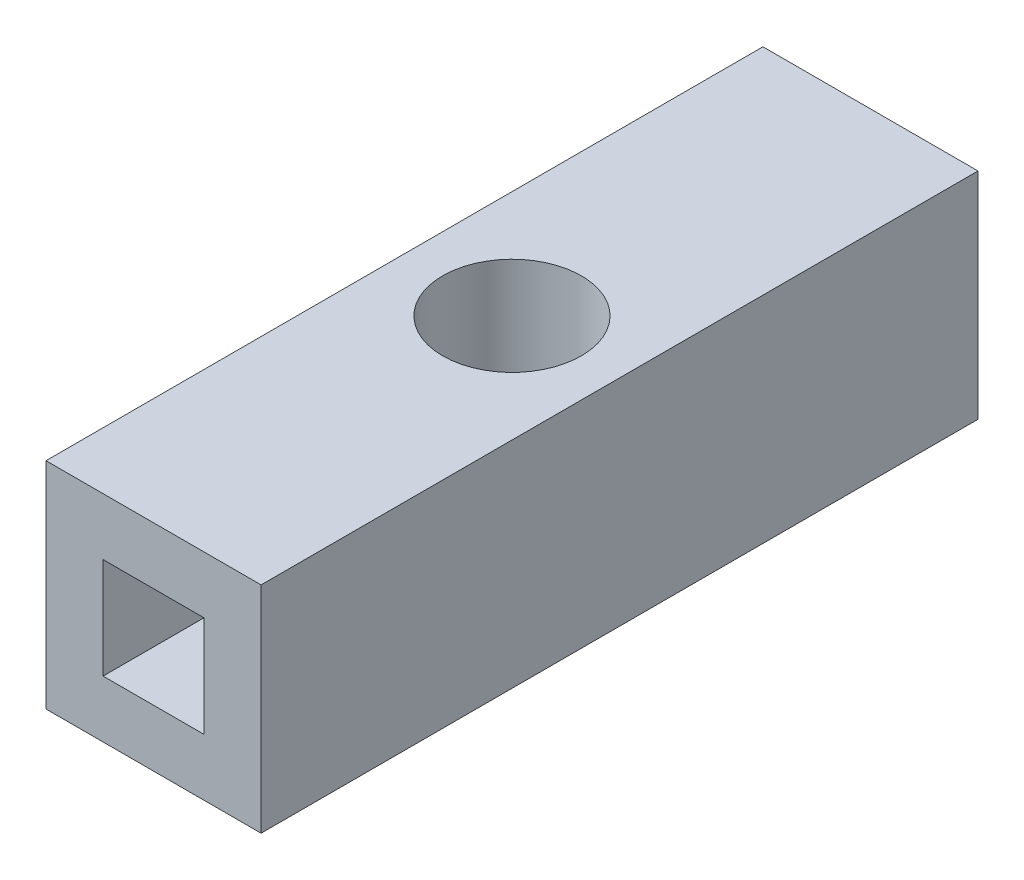
ISO-10303-21;
HEADER;
FILE_DESCRIPTION(('STEP AP214'),'2;1');
FILE_NAME('part.step','',(''),(''),'','','');
FILE_SCHEMA(('AUTOMOTIVE_DESIGN { 1 0 10303 214 1 1 1 1 }'));
ENDSEC;
DATA;
#1=APPLICATION_CONTEXT('core data for automotive mechanical design processes');
#2=APPLICATION_PROTOCOL_DEFINITION('international standard','automotive_design',2000,#1);
#3=PRODUCT_CONTEXT('',#1,'mechanical');
#4=PRODUCT('Part','Part','',(#3));
#5=PRODUCT_RELATED_PRODUCT_CATEGORY('part','',(#4));
#6=PRODUCT_DEFINITION_FORMATION('','',#4);
#7=PRODUCT_DEFINITION_CONTEXT('part definition',#1,'design');
#8=PRODUCT_DEFINITION('design','',#6,#7);
#9=PRODUCT_DEFINITION_SHAPE('','',#8);
#10=(LENGTH_UNIT() NAMED_UNIT(*) SI_UNIT(.MILLI.,.METRE.));
#11=(NAMED_UNIT(*) PLANE_ANGLE_UNIT() SI_UNIT($,.RADIAN.));
#12=(NAMED_UNIT(*) SI_UNIT($,.STERADIAN.) SOLID_ANGLE_UNIT());
#13=UNCERTAINTY_MEASURE_WITH_UNIT(LENGTH_MEASURE(1.E-05),#10,'distance_accuracy_value','');
#14=(GEOMETRIC_REPRESENTATION_CONTEXT(3) GLOBAL_UNCERTAINTY_ASSIGNED_CONTEXT((#13)) GLOBAL_UNIT_ASSIGNED_CONTEXT((#10,
#11,#12)) REPRESENTATION_CONTEXT('',''));
#15=CARTESIAN_POINT('',(0.,0.,0.));
#16=DIRECTION('',(0.,0.,1.));
#17=DIRECTION('',(1.,0.,0.));
#18=AXIS2_PLACEMENT_3D('',#15,#16,#17);
#19=CARTESIAN_POINT('',(3.81,3.81,12.7));
#20=DIRECTION('',(-1.,0.,0.));
#21=DIRECTION('',(0.,-1.,0.));
#22=AXIS2_PLACEMENT_3D('',#19,#20,#21);
#23=PLANE('',#22);
#24=DIRECTION('',(0.,1.,0.));
#25=VECTOR('',#24,1.);
#26=CARTESIAN_POINT('',(3.81,3.81,-12.7));
#27=LINE('',#26,#25);
#28=CARTESIAN_POINT('',(3.81,-3.81,-12.7));
#29=VERTEX_POINT('',#28);
#30=CARTESIAN_POINT('',(3.81,3.81,-12.7));
#31=VERTEX_POINT('',#30);
#32=EDGE_CURVE('E165',#29,#31,#27,.T.);
#33=ORIENTED_EDGE('',*,*,#32,.T.);
#34=DIRECTION('',(0.,0.,-1.));
#35=VECTOR('',#34,1.);
#36=CARTESIAN_POINT('',(3.81,3.81,12.7));
#37=LINE('',#36,#35);
#38=CARTESIAN_POINT('',(3.81,3.81,12.7));
#39=VERTEX_POINT('',#38);
#40=EDGE_CURVE('E12',#39,#31,#37,.T.);
#41=ORIENTED_EDGE('',*,*,#40,.F.);
#42=DIRECTION('',(0.,1.,0.));
#43=VECTOR('',#42,1.);
#44=CARTESIAN_POINT('',(3.81,3.81,12.7));
#45=LINE('',#44,#43);
#46=CARTESIAN_POINT('',(3.81,-3.81,12.7));
#47=VERTEX_POINT('',#46);
#48=EDGE_CURVE('E166',#47,#39,#45,.T.);
#49=ORIENTED_EDGE('',*,*,#48,.F.);
#50=DIRECTION('',(0.,0.,-1.));
#51=VECTOR('',#50,1.);
#52=CARTESIAN_POINT('',(3.81,-3.81,12.7));
#53=LINE('',#52,#51);
#54=EDGE_CURVE('E176',#47,#29,#53,.T.);
#55=ORIENTED_EDGE('',*,*,#54,.T.);
#56=EDGE_LOOP('',(#33,#41,#49,#55));
#57=FACE_BOUND('',#56,.T.);
#58=ADVANCED_FACE('F35',(#57),#23,.F.);
#59=CARTESIAN_POINT('',(-3.81,3.81,12.7));
#60=DIRECTION('',(0.,-1.,0.));
#61=DIRECTION('',(0.,0.,-1.));
#62=AXIS2_PLACEMENT_3D('',#59,#60,#61);
#63=PLANE('',#62);
#64=CARTESIAN_POINT('',(0.,3.81,0.));
#65=DIRECTION('',(0.,1.,0.));
#66=DIRECTION('',(0.,0.,1.));
#67=AXIS2_PLACEMENT_3D('',#64,#65,#66);
#68=CIRCLE('',#67,2.45745);
#69=CARTESIAN_POINT('',(0.,3.81,2.45745));
#70=VERTEX_POINT('',#69);
#71=EDGE_CURVE('E151',#70,#70,#68,.T.);
#72=ORIENTED_EDGE('',*,*,#71,.F.);
#73=EDGE_LOOP('',(#72));
#74=FACE_BOUND('',#73,.T.);
#75=DIRECTION('',(-1.,0.,0.));
#76=VECTOR('',#75,1.);
#77=CARTESIAN_POINT('',(-3.81,3.81,-12.7));
#78=LINE('',#77,#76);
#79=CARTESIAN_POINT('',(-3.81,3.81,-12.7));
#80=VERTEX_POINT('',#79);
#81=EDGE_CURVE('E179',#31,#80,#78,.T.);
#82=ORIENTED_EDGE('',*,*,#81,.T.);
#83=DIRECTION('',(0.,0.,-1.));
#84=VECTOR('',#83,1.);
#85=CARTESIAN_POINT('',(-3.81,3.81,12.7));
#86=LINE('',#85,#84);
#87=CARTESIAN_POINT('',(-3.81,3.81,12.7));
#88=VERTEX_POINT('',#87);
#89=EDGE_CURVE('E42',#88,#80,#86,.T.);
#90=ORIENTED_EDGE('',*,*,#89,.F.);
#91=DIRECTION('',(-1.,0.,0.));
#92=VECTOR('',#91,1.);
#93=CARTESIAN_POINT('',(-3.81,3.81,12.7));
#94=LINE('',#93,#92);
#95=EDGE_CURVE('E169',#39,#88,#94,.T.);
#96=ORIENTED_EDGE('',*,*,#95,.F.);
#97=ORIENTED_EDGE('',*,*,#40,.T.);
#98=EDGE_LOOP('',(#82,#90,#96,#97));
#99=FACE_BOUND('',#98,.T.);
#100=ADVANCED_FACE('F207',(#74,#99),#63,.F.);
#101=CARTESIAN_POINT('',(-3.81,3.81,12.7));
#102=DIRECTION('',(1.,0.,0.));
#103=DIRECTION('',(0.,1.,0.));
#104=AXIS2_PLACEMENT_3D('',#101,#102,#103);
#105=PLANE('',#104);
#106=DIRECTION('',(0.,-1.,0.));
#107=VECTOR('',#106,1.);
#108=CARTESIAN_POINT('',(-3.81,3.81,-12.7));
#109=LINE('',#108,#107);
#110=CARTESIAN_POINT('',(-3.81,-3.81,-12.7));
#111=VERTEX_POINT('',#110);
#112=EDGE_CURVE('E181',#80,#111,#109,.T.);
#113=ORIENTED_EDGE('',*,*,#112,.T.);
#114=DIRECTION('',(0.,0.,-1.));
#115=VECTOR('',#114,1.);
#116=CARTESIAN_POINT('',(-3.81,-3.81,12.7));
#117=LINE('',#116,#115);
#118=CARTESIAN_POINT('',(-3.81,-3.81,12.7));
#119=VERTEX_POINT('',#118);
#120=EDGE_CURVE('E186',#119,#111,#117,.T.);
#121=ORIENTED_EDGE('',*,*,#120,.F.);
#122=DIRECTION('',(0.,-1.,0.));
#123=VECTOR('',#122,1.);
#124=CARTESIAN_POINT('',(-3.81,3.81,12.7));
#125=LINE('',#124,#123);
#126=EDGE_CURVE('E172',#88,#119,#125,.T.);
#127=ORIENTED_EDGE('',*,*,#126,.F.);
#128=ORIENTED_EDGE('',*,*,#89,.T.);
#129=EDGE_LOOP('',(#113,#121,#127,#128));
#130=FACE_BOUND('',#129,.T.);
#131=ADVANCED_FACE('F193',(#130),#105,.F.);
#132=CARTESIAN_POINT('',(-3.81,-3.81,12.7));
#133=DIRECTION('',(0.,1.,0.));
#134=DIRECTION('',(0.,0.,1.));
#135=AXIS2_PLACEMENT_3D('',#132,#133,#134);
#136=PLANE('',#135);
#137=CARTESIAN_POINT('',(0.,-3.81,0.));
#138=DIRECTION('',(0.,1.,0.));
#139=DIRECTION('',(0.,0.,1.));
#140=AXIS2_PLACEMENT_3D('',#137,#138,#139);
#141=CIRCLE('',#140,2.45745);
#142=CARTESIAN_POINT('',(0.,-3.81,2.45745));
#143=VERTEX_POINT('',#142);
#144=EDGE_CURVE('E162',#143,#143,#141,.T.);
#145=ORIENTED_EDGE('',*,*,#144,.T.);
#146=EDGE_LOOP('',(#145));
#147=FACE_BOUND('',#146,.T.);
#148=DIRECTION('',(1.,0.,0.));
#149=VECTOR('',#148,1.);
#150=CARTESIAN_POINT('',(-3.81,-3.81,-12.7));
#151=LINE('',#150,#149);
#152=EDGE_CURVE('E170',#111,#29,#151,.T.);
#153=ORIENTED_EDGE('',*,*,#152,.T.);
#154=ORIENTED_EDGE('',*,*,#54,.F.);
#155=DIRECTION('',(1.,0.,0.));
#156=VECTOR('',#155,1.);
#157=CARTESIAN_POINT('',(-3.81,-3.81,12.7));
#158=LINE('',#157,#156);
#159=EDGE_CURVE('E174',#119,#47,#158,.T.);
#160=ORIENTED_EDGE('',*,*,#159,.F.);
#161=ORIENTED_EDGE('',*,*,#120,.T.);
#162=EDGE_LOOP('',(#153,#154,#160,#161));
#163=FACE_BOUND('',#162,.T.);
#164=ADVANCED_FACE('F200',(#147,#163),#136,.F.);
#165=CARTESIAN_POINT('',(0.,0.,12.7));
#166=DIRECTION('',(0.,0.,1.));
#167=DIRECTION('',(1.,0.,0.));
#168=AXIS2_PLACEMENT_3D('',#165,#166,#167);
#169=PLANE('',#168);
#170=DIRECTION('',(1.,0.,0.));
#171=VECTOR('',#170,1.);
#172=CARTESIAN_POINT('',(-1.7875,-1.7875,12.7));
#173=LINE('',#172,#171);
#174=CARTESIAN_POINT('',(-1.7875,-1.7875,12.7));
#175=VERTEX_POINT('',#174);
#176=CARTESIAN_POINT('',(1.7875,-1.7875,12.7));
#177=VERTEX_POINT('',#176);
#178=EDGE_CURVE('E57',#175,#177,#173,.T.);
#179=ORIENTED_EDGE('',*,*,#178,.F.);
#180=DIRECTION('',(0.,-1.,0.));
#181=VECTOR('',#180,1.);
#182=CARTESIAN_POINT('',(-1.7875,1.7875,12.7));
#183=LINE('',#182,#181);
#184=CARTESIAN_POINT('',(-1.7875,1.7875,12.7));
#185=VERTEX_POINT('',#184);
#186=EDGE_CURVE('E139',#185,#175,#183,.T.);
#187=ORIENTED_EDGE('',*,*,#186,.F.);
#188=DIRECTION('',(-1.,0.,0.));
#189=VECTOR('',#188,1.);
#190=CARTESIAN_POINT('',(1.7875,1.7875,12.7));
#191=LINE('',#190,#189);
#192=CARTESIAN_POINT('',(1.7875,1.7875,12.7));
#193=VERTEX_POINT('',#192);
#194=EDGE_CURVE('E142',#193,#185,#191,.T.);
#195=ORIENTED_EDGE('',*,*,#194,.F.);
#196=DIRECTION('',(0.,1.,0.));
#197=VECTOR('',#196,1.);
#198=CARTESIAN_POINT('',(1.7875,-1.7875,12.7));
#199=LINE('',#198,#197);
#200=EDGE_CURVE('E134',#177,#193,#199,.T.);
#201=ORIENTED_EDGE('',*,*,#200,.F.);
#202=EDGE_LOOP('',(#179,#187,#195,#201));
#203=FACE_BOUND('',#202,.T.);
#204=ORIENTED_EDGE('',*,*,#48,.T.);
#205=ORIENTED_EDGE('',*,*,#95,.T.);
#206=ORIENTED_EDGE('',*,*,#126,.T.);
#207=ORIENTED_EDGE('',*,*,#159,.T.);
#208=EDGE_LOOP('',(#204,#205,#206,#207));
#209=FACE_BOUND('',#208,.T.);
#210=ADVANCED_FACE('F206',(#203,#209),#169,.T.);
#211=CARTESIAN_POINT('',(0.,0.,-12.7));
#212=DIRECTION('',(0.,0.,1.));
#213=DIRECTION('',(1.,0.,0.));
#214=AXIS2_PLACEMENT_3D('',#211,#212,#213);
#215=PLANE('',#214);
#216=CARTESIAN_POINT('',(0.,0.,-12.7));
#217=DIRECTION('',(0.,0.,-1.));
#218=DIRECTION('',(-1.,0.,0.));
#219=AXIS2_PLACEMENT_3D('',#216,#217,#218);
#220=CIRCLE('',#219,2.20000006400011);
#221=CARTESIAN_POINT('',(-1.699999936,1.39642418311933,-12.7));
#222=VERTEX_POINT('',#221);
#223=CARTESIAN_POINT('',(-1.699999936,-1.39642418311933,-12.7));
#224=VERTEX_POINT('',#223);
#225=EDGE_CURVE('E121',#222,#224,#220,.T.);
#226=ORIENTED_EDGE('',*,*,#225,.F.);
#227=DIRECTION('',(0.,1.,0.));
#228=VECTOR('',#227,1.);
#229=CARTESIAN_POINT('',(-1.699999936,-1.39642418311933,-12.7));
#230=LINE('',#229,#228);
#231=EDGE_CURVE('E49',#224,#222,#230,.T.);
#232=ORIENTED_EDGE('',*,*,#231,.F.);
#233=EDGE_LOOP('',(#226,#232));
#234=FACE_BOUND('',#233,.T.);
#235=ORIENTED_EDGE('',*,*,#32,.F.);
#236=ORIENTED_EDGE('',*,*,#152,.F.);
#237=ORIENTED_EDGE('',*,*,#112,.F.);
#238=ORIENTED_EDGE('',*,*,#81,.F.);
#239=EDGE_LOOP('',(#235,#236,#237,#238));
#240=FACE_BOUND('',#239,.T.);
#241=ADVANCED_FACE('F125',(#234,#240),#215,.F.);
#242=CARTESIAN_POINT('',(0.,3.81,0.));
#243=DIRECTION('',(0.,1.,0.));
#244=DIRECTION('',(0.,0.,1.));
#245=AXIS2_PLACEMENT_3D('',#242,#243,#244);
#246=CYLINDRICAL_SURFACE('',#245,2.45745);
#247=ORIENTED_EDGE('',*,*,#144,.F.);
#248=EDGE_LOOP('',(#247));
#249=FACE_BOUND('',#248,.T.);
#250=ORIENTED_EDGE('',*,*,#71,.T.);
#251=EDGE_LOOP('',(#250));
#252=FACE_BOUND('',#251,.T.);
#253=ADVANCED_FACE('F222',(#249,#252),#246,.F.);
#254=CARTESIAN_POINT('',(-1.7875,-1.7875,-12.701));
#255=DIRECTION('',(0.,-1.,0.));
#256=DIRECTION('',(0.,0.,-1.));
#257=AXIS2_PLACEMENT_3D('',#254,#255,#256);
#258=PLANE('',#257);
#259=CARTESIAN_POINT('',(0.,-1.7875,0.));
#260=DIRECTION('',(0.,-1.,0.));
#261=DIRECTION('',(0.,0.,-1.));
#262=AXIS2_PLACEMENT_3D('',#259,#260,#261);
#263=CIRCLE('',#262,3.47345);
#264=CARTESIAN_POINT('',(1.7875,-1.7875,2.97820393064343));
#265=VERTEX_POINT('',#264);
#266=CARTESIAN_POINT('',(-1.7875,-1.7875,2.97820393064343));
#267=VERTEX_POINT('',#266);
#268=EDGE_CURVE('E148',#265,#267,#263,.T.);
#269=ORIENTED_EDGE('',*,*,#268,.T.);
#270=DIRECTION('',(0.,0.,1.));
#271=VECTOR('',#270,1.);
#272=CARTESIAN_POINT('',(-1.7875,-1.7875,-12.701));
#273=LINE('',#272,#271);
#274=EDGE_CURVE('E156',#267,#175,#273,.T.);
#275=ORIENTED_EDGE('',*,*,#274,.T.);
#276=ORIENTED_EDGE('',*,*,#178,.T.);
#277=DIRECTION('',(0.,0.,1.));
#278=VECTOR('',#277,1.);
#279=CARTESIAN_POINT('',(1.7875,-1.7875,-12.701));
#280=LINE('',#279,#278);
#281=EDGE_CURVE('E133',#265,#177,#280,.T.);
#282=ORIENTED_EDGE('',*,*,#281,.F.);
#283=EDGE_LOOP('',(#269,#275,#276,#282));
#284=FACE_BOUND('',#283,.T.);
#285=ADVANCED_FACE('F228',(#284),#258,.F.);
#286=CARTESIAN_POINT('',(-1.7875,1.7875,-12.701));
#287=DIRECTION('',(-1.,0.,0.));
#288=DIRECTION('',(0.,0.,1.));
#289=AXIS2_PLACEMENT_3D('',#286,#287,#288);
#290=PLANE('',#289);
#291=DIRECTION('',(0.,1.,0.));
#292=VECTOR('',#291,1.);
#293=CARTESIAN_POINT('',(-1.7875,3.81,2.97820393064343));
#294=LINE('',#293,#292);
#295=CARTESIAN_POINT('',(-1.7875,1.7875,2.97820393064343));
#296=VERTEX_POINT('',#295);
#297=EDGE_CURVE('E149',#267,#296,#294,.T.);
#298=ORIENTED_EDGE('',*,*,#297,.T.);
#299=DIRECTION('',(0.,0.,1.));
#300=VECTOR('',#299,1.);
#301=CARTESIAN_POINT('',(-1.7875,1.7875,-12.701));
#302=LINE('',#301,#300);
#303=EDGE_CURVE('E154',#296,#185,#302,.T.);
#304=ORIENTED_EDGE('',*,*,#303,.T.);
#305=ORIENTED_EDGE('',*,*,#186,.T.);
#306=ORIENTED_EDGE('',*,*,#274,.F.);
#307=EDGE_LOOP('',(#298,#304,#305,#306));
#308=FACE_BOUND('',#307,.T.);
#309=ADVANCED_FACE('F250',(#308),#290,.F.);
#310=CARTESIAN_POINT('',(1.7875,1.7875,-12.701));
#311=DIRECTION('',(0.,1.,0.));
#312=DIRECTION('',(0.,0.,1.));
#313=AXIS2_PLACEMENT_3D('',#310,#311,#312);
#314=PLANE('',#313);
#315=CARTESIAN_POINT('',(0.,1.7875,0.));
#316=DIRECTION('',(0.,1.,0.));
#317=DIRECTION('',(0.,0.,1.));
#318=AXIS2_PLACEMENT_3D('',#315,#316,#317);
#319=CIRCLE('',#318,3.47345);
#320=CARTESIAN_POINT('',(1.7875,1.7875,2.97820393064343));
#321=VERTEX_POINT('',#320);
#322=EDGE_CURVE('E137',#296,#321,#319,.T.);
#323=ORIENTED_EDGE('',*,*,#322,.T.);
#324=DIRECTION('',(0.,0.,1.));
#325=VECTOR('',#324,1.);
#326=CARTESIAN_POINT('',(1.7875,1.7875,-12.701));
#327=LINE('',#326,#325);
#328=EDGE_CURVE('E145',#321,#193,#327,.T.);
#329=ORIENTED_EDGE('',*,*,#328,.T.);
#330=ORIENTED_EDGE('',*,*,#194,.T.);
#331=ORIENTED_EDGE('',*,*,#303,.F.);
#332=EDGE_LOOP('',(#323,#329,#330,#331));
#333=FACE_BOUND('',#332,.T.);
#334=ADVANCED_FACE('F240',(#333),#314,.F.);
#335=CARTESIAN_POINT('',(1.7875,-1.7875,-12.701));
#336=DIRECTION('',(1.,0.,0.));
#337=DIRECTION('',(0.,0.,-1.));
#338=AXIS2_PLACEMENT_3D('',#335,#336,#337);
#339=PLANE('',#338);
#340=DIRECTION('',(0.,1.,0.));
#341=VECTOR('',#340,1.);
#342=CARTESIAN_POINT('',(1.7875,3.81,2.97820393064343));
#343=LINE('',#342,#341);
#344=EDGE_CURVE('E146',#321,#265,#343,.F.);
#345=ORIENTED_EDGE('',*,*,#344,.T.);
#346=ORIENTED_EDGE('',*,*,#281,.T.);
#347=ORIENTED_EDGE('',*,*,#200,.T.);
#348=ORIENTED_EDGE('',*,*,#328,.F.);
#349=EDGE_LOOP('',(#345,#346,#347,#348));
#350=FACE_BOUND('',#349,.T.);
#351=ADVANCED_FACE('F233',(#350),#339,.F.);
#352=CARTESIAN_POINT('',(0.,3.81,0.));
#353=DIRECTION('',(0.,1.,0.));
#354=DIRECTION('',(0.,0.,1.));
#355=AXIS2_PLACEMENT_3D('',#352,#353,#354);
#356=CYLINDRICAL_SURFACE('',#355,3.47345);
#357=ORIENTED_EDGE('',*,*,#322,.F.);
#358=ORIENTED_EDGE('',*,*,#297,.F.);
#359=ORIENTED_EDGE('',*,*,#268,.F.);
#360=ORIENTED_EDGE('',*,*,#344,.F.);
#361=EDGE_LOOP('',(#357,#358,#359,#360));
#362=FACE_BOUND('',#361,.T.);
#363=ADVANCED_FACE('F230',(#362),#356,.T.);
#364=CARTESIAN_POINT('',(-1.699999936,-1.39642418311933,12.701));
#365=DIRECTION('',(-1.,0.,0.));
#366=DIRECTION('',(0.,0.,1.));
#367=AXIS2_PLACEMENT_3D('',#364,#365,#366);
#368=PLANE('',#367);
#369=DIRECTION('',(0.,1.,0.));
#370=VECTOR('',#369,1.);
#371=CARTESIAN_POINT('',(-1.699999936,3.81,-3.02900233081785));
#372=LINE('',#371,#370);
#373=CARTESIAN_POINT('',(-1.699999936,1.39642418311933,-3.02900233081784));
#374=VERTEX_POINT('',#373);
#375=CARTESIAN_POINT('',(-1.699999936,-1.39642418311933,-3.02900233081785));
#376=VERTEX_POINT('',#375);
#377=EDGE_CURVE('E115',#374,#376,#372,.F.);
#378=ORIENTED_EDGE('',*,*,#377,.T.);
#379=DIRECTION('',(0.,0.,-1.));
#380=VECTOR('',#379,1.);
#381=CARTESIAN_POINT('',(-1.699999936,-1.39642418311933,12.701));
#382=LINE('',#381,#380);
#383=EDGE_CURVE('E111',#376,#224,#382,.T.);
#384=ORIENTED_EDGE('',*,*,#383,.T.);
#385=ORIENTED_EDGE('',*,*,#231,.T.);
#386=DIRECTION('',(0.,0.,-1.));
#387=VECTOR('',#386,1.);
#388=CARTESIAN_POINT('',(-1.699999936,1.39642418311933,12.701));
#389=LINE('',#388,#387);
#390=EDGE_CURVE('E118',#374,#222,#389,.T.);
#391=ORIENTED_EDGE('',*,*,#390,.F.);
#392=EDGE_LOOP('',(#378,#384,#385,#391));
#393=FACE_BOUND('',#392,.T.);
#394=ADVANCED_FACE('F113',(#393),#368,.F.);
#395=CARTESIAN_POINT('',(0.,0.,12.701));
#396=DIRECTION('',(0.,0.,-1.));
#397=DIRECTION('',(-1.,0.,0.));
#398=AXIS2_PLACEMENT_3D('',#395,#396,#397);
#399=CYLINDRICAL_SURFACE('',#398,2.20000006400011);
#400=CARTESIAN_POINT('',(-1.699999936,-1.39642418311933,-3.02900233081785));
#401=CARTESIAN_POINT('',(-1.66091071626124,-1.44399620708811,-3.05094152030823));
#402=CARTESIAN_POINT('',(-1.61987872033584,-1.48988945480585,-3.07297357990735));
#403=CARTESIAN_POINT('',(-1.53400741157414,-1.57817237764945,-3.11672931127827));
#404=CARTESIAN_POINT('',(-1.48916620748426,-1.62056029153898,-3.13845282353649));
#405=CARTESIAN_POINT('',(-1.34850282838825,-1.74270321282816,-3.20266136929827));
#406=CARTESIAN_POINT('',(-1.24704995194177,-1.81681590794009,-3.24388678043658));
#407=CARTESIAN_POINT('',(-1.03052218090334,-1.94784430647262,-3.31904587232249));
#408=CARTESIAN_POINT('',(-0.915396624885104,-2.00469308965868,-3.35295103445591));
#409=CARTESIAN_POINT('',(-0.674858300807985,-2.09787817299546,-3.40948266142463));
#410=CARTESIAN_POINT('',(-0.549483468533163,-2.13428651320565,-3.43214870386373));
#411=CARTESIAN_POINT('',(-0.307187405201924,-2.18153714600308,-3.46174320916831));
#412=CARTESIAN_POINT('',(-0.190923667936593,-2.19481377746777,-3.4701668857097));
#413=CARTESIAN_POINT('',(0.0425401518803911,-2.20268363072507,-3.4751482214604));
#414=CARTESIAN_POINT('',(0.159740326747969,-2.19727498723565,-3.47170469601081));
#415=CARTESIAN_POINT('',(0.379356532822022,-2.16958930388246,-3.4542550826027));
#416=CARTESIAN_POINT('',(0.4820858403116,-2.14903880387401,-3.44133066879947));
#417=CARTESIAN_POINT('',(0.682304661189426,-2.09409634441932,-3.40729067933152));
#418=CARTESIAN_POINT('',(0.779794274268547,-2.05970464842259,-3.38617525957244));
#419=CARTESIAN_POINT('',(0.972378720809013,-1.97637249518646,-3.33612601396781));
#420=CARTESIAN_POINT('',(1.0671007142458,-1.92678207343487,-3.30684968912752));
#421=CARTESIAN_POINT('',(1.24720704859317,-1.81540722209198,-3.24321895237224));
#422=CARTESIAN_POINT('',(1.33258540086822,-1.75361504232655,-3.2088613164677));
#423=CARTESIAN_POINT('',(1.50472385595164,-1.6094060550015,-3.13221565849268));
#424=CARTESIAN_POINT('',(1.5898766731231,-1.52529642441551,-3.08950119985349));
#425=CARTESIAN_POINT('',(1.74558529626195,-1.34431933160926,-3.00427538497207));
#426=CARTESIAN_POINT('',(1.81613251126571,-1.24744441540032,-2.96176416255147));
#427=CARTESIAN_POINT('',(1.93654300856871,-1.04983865868206,-2.88433513436212));
#428=CARTESIAN_POINT('',(1.98756293356158,-0.949945904770163,-2.84908668748266));
#429=CARTESIAN_POINT('',(2.0743530216508,-0.741455893109134,-2.7865373541016));
#430=CARTESIAN_POINT('',(2.11014840208349,-0.632873386060488,-2.75922334928531));
#431=CARTESIAN_POINT('',(2.16033502755328,-0.426989325582638,-2.7200482809667));
#432=CARTESIAN_POINT('',(2.17722551487073,-0.330641328863083,-2.70642009867979));
#433=CARTESIAN_POINT('',(2.19799452589584,-0.135674823224019,-2.68958482935163));
#434=CARTESIAN_POINT('',(2.20188383371469,-0.0370582644208177,-2.68636910553962));
#435=CARTESIAN_POINT('',(2.19641051986584,0.15956503458409,-2.69084452116427));
#436=CARTESIAN_POINT('',(2.18704449164063,0.257571611521245,-2.69853846433373));
#437=CARTESIAN_POINT('',(2.15564739209651,0.450261957676556,-2.72367942020842));
#438=CARTESIAN_POINT('',(2.13360502224062,0.544942682544494,-2.74113513328343));
#439=CARTESIAN_POINT('',(2.07729687211082,0.731110510261208,-2.78405490138854));
#440=CARTESIAN_POINT('',(2.04276090083328,0.822473593106937,-2.80969437249615));
#441=CARTESIAN_POINT('',(1.96273790302305,0.998509786703004,-2.86616670391023));
#442=CARTESIAN_POINT('',(1.91724650532789,1.08318020915817,-2.89700163570185));
#443=CARTESIAN_POINT('',(1.80538958043756,1.2625393081406,-2.96828274299416));
#444=CARTESIAN_POINT('',(1.73664006341236,1.35548962170063,-3.00937296432643));
#445=CARTESIAN_POINT('',(1.58546605777844,1.52957746116058,-3.09169502089241));
#446=CARTESIAN_POINT('',(1.50302682487534,1.6107020715247,-3.13292696135776));
#447=CARTESIAN_POINT('',(1.31361177307451,1.76965038831294,-3.21735887987165));
#448=CARTESIAN_POINT('',(1.20483075342928,1.84559908295021,-3.2600909012221));
#449=CARTESIAN_POINT('',(0.972973264943279,1.97764180301712,-3.33661959352223));
#450=CARTESIAN_POINT('',(0.849910380908388,2.03375449400849,-3.3704246570657));
#451=CARTESIAN_POINT('',(0.604836069920068,2.11881986649583,-3.42245990871317));
#452=CARTESIAN_POINT('',(0.483783537806089,2.14980720231539,-3.44184289896395));
#453=CARTESIAN_POINT('',(0.236859305126179,2.19077745019083,-3.46757774539759));
#454=CARTESIAN_POINT('',(0.110993107583919,2.20078365789639,-3.47394405399439));
#455=CARTESIAN_POINT('',(-0.12250149609636,2.19923677454123,-3.47296848505081));
#456=CARTESIAN_POINT('',(-0.230170867813737,2.19055486703036,-3.4674521291049));
#457=CARTESIAN_POINT('',(-0.442142373603857,2.15777769100403,-3.44683847229328));
#458=CARTESIAN_POINT('',(-0.54644543523394,2.13368670707813,-3.4317438347376));
#459=CARTESIAN_POINT('',(-0.7480378959646,2.07158556285027,-3.39348386960819));
#460=CARTESIAN_POINT('',(-0.845386101837611,2.03371438534787,-3.37039923632122));
#461=CARTESIAN_POINT('',(-1.03247469075437,1.94543628161739,-3.31787845753296));
#462=CARTESIAN_POINT('',(-1.12220395325858,1.89501144008172,-3.28843324287545));
#463=CARTESIAN_POINT('',(-1.30116556107588,1.77750568098755,-3.2220796869472));
#464=CARTESIAN_POINT('',(-1.38947686055339,1.70927281131205,-3.18472177341872));
#465=CARTESIAN_POINT('',(-1.51286922994303,1.59821276443897,-3.12700262199391));
#466=CARTESIAN_POINT('',(-1.55244120119045,1.55979752112405,-3.10750942469727));
#467=CARTESIAN_POINT('',(-1.62852667243859,1.48017690650671,-3.06831950745301));
#468=CARTESIAN_POINT('',(-1.66504134745756,1.43897261823818,-3.0486228689944));
#469=CARTESIAN_POINT('',(-1.699999936,1.39642418311933,-3.02900233081785));
#470=B_SPLINE_CURVE_WITH_KNOTS('',3,(#400,#401,#402,#403,#404,#405,#406,#407,#408,#409,#410,
#411,#412,#413,#414,#415,#416,#417,#418,#419,#420,#421,#422,#423,#424,#425,#426,#427,#428,#429,
#430,#431,#432,#433,#434,#435,#436,#437,#438,#439,#440,#441,#442,#443,#444,#445,#446,#447,#448,
#449,#450,#451,#452,#453,#454,#455,#456,#457,#458,#459,#460,#461,#462,#463,#464,#465,#466,#467,
#468,#469),.UNSPECIFIED.,.F.,.F.,(4,2,2,2,2,2,2,2,2,2,2,2,2,2,2,2,2,2,2,2,2,2,2,2,2,2,2,2,2,2,2,
2,2,2,4),(0.,0.195980412725759,0.392058703943754,0.786756279821944,1.18296484986586,
1.57776811720038,1.92772438052236,2.27771557969581,2.59298822891056,2.90825487759602,
3.23952680696673,3.57100983065459,3.95073563103827,4.33068415418157,4.68205457797275,
5.03284071745211,5.32781937415399,5.62255329359735,5.9173629719938,6.21243582505351,
6.51431412418699,6.81631307145118,7.18299392551385,7.5500722998391,7.96598653030746,
8.38150833957441,8.75853324193824,9.13513930595586,9.45803527742583,9.78084150466985,
10.1004783728094,10.4205740354311,10.7722259479848,10.9475884437683,11.1228832296808),.UNSPECIFIED.);
#471=EDGE_CURVE('E130',#376,#374,#470,.T.);
#472=ORIENTED_EDGE('',*,*,#471,.T.);
#473=ORIENTED_EDGE('',*,*,#390,.T.);
#474=ORIENTED_EDGE('',*,*,#225,.T.);
#475=ORIENTED_EDGE('',*,*,#383,.F.);
#476=EDGE_LOOP('',(#472,#473,#474,#475));
#477=FACE_BOUND('',#476,.T.);
#478=ADVANCED_FACE('F122',(#477),#399,.F.);
#479=CARTESIAN_POINT('',(0.,3.81,0.));
#480=DIRECTION('',(0.,1.,0.));
#481=DIRECTION('',(0.,0.,1.));
#482=AXIS2_PLACEMENT_3D('',#479,#480,#481);
#483=CYLINDRICAL_SURFACE('',#482,3.47345);
#484=ORIENTED_EDGE('',*,*,#471,.F.);
#485=ORIENTED_EDGE('',*,*,#377,.F.);
#486=EDGE_LOOP('',(#484,#485));
#487=FACE_BOUND('',#486,.T.);
#488=ADVANCED_FACE('F235',(#487),#483,.T.);
#489=CLOSED_SHELL('',(#58,#100,#131,#164,#210,#241,#253,#285,#309,#334,#351,#363,#394,#478,#488));
#490=MANIFOLD_SOLID_BREP('B2',#489);
#491=ADVANCED_BREP_SHAPE_REPRESENTATION('',(#18,#490),#14);
#492=SHAPE_DEFINITION_REPRESENTATION(#9,#491);
ENDSEC;
END-ISO-10303-21;
